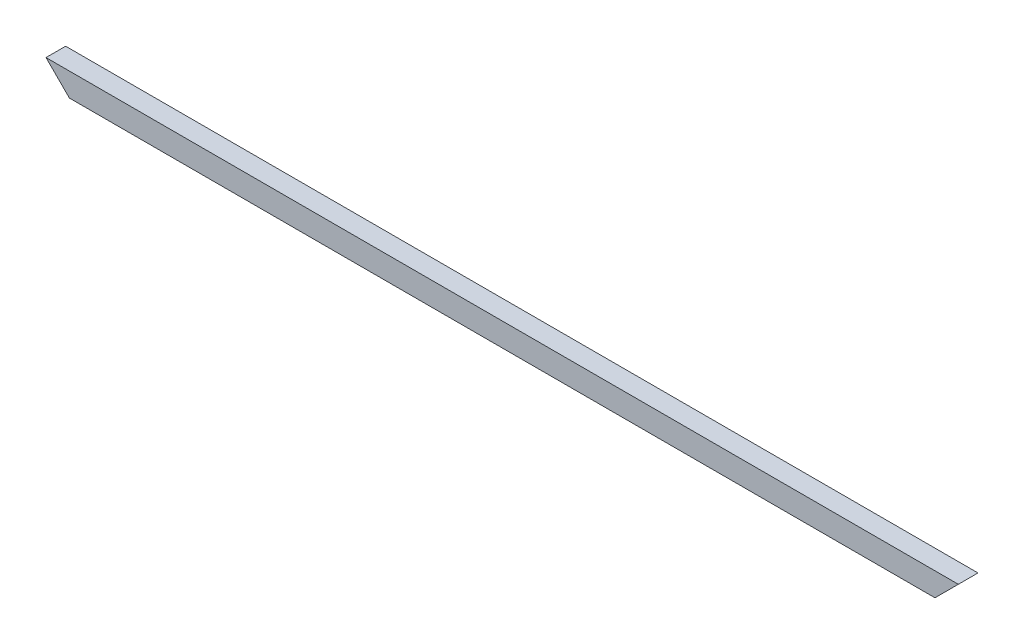
ISO-10303-21;
HEADER;
FILE_DESCRIPTION(('STEP AP214'),'2;1');
FILE_NAME('part.step','',(''),(''),'','','');
FILE_SCHEMA(('AUTOMOTIVE_DESIGN { 1 0 10303 214 1 1 1 1 }'));
ENDSEC;
DATA;
#1=APPLICATION_CONTEXT('core data for automotive mechanical design processes');
#2=APPLICATION_PROTOCOL_DEFINITION('international standard','automotive_design',2000,#1);
#3=PRODUCT_CONTEXT('',#1,'mechanical');
#4=PRODUCT('Part','Part','',(#3));
#5=PRODUCT_RELATED_PRODUCT_CATEGORY('part','',(#4));
#6=PRODUCT_DEFINITION_FORMATION('','',#4);
#7=PRODUCT_DEFINITION_CONTEXT('part definition',#1,'design');
#8=PRODUCT_DEFINITION('design','',#6,#7);
#9=PRODUCT_DEFINITION_SHAPE('','',#8);
#10=(LENGTH_UNIT() NAMED_UNIT(*) SI_UNIT(.MILLI.,.METRE.));
#11=(NAMED_UNIT(*) PLANE_ANGLE_UNIT() SI_UNIT($,.RADIAN.));
#12=(NAMED_UNIT(*) SI_UNIT($,.STERADIAN.) SOLID_ANGLE_UNIT());
#13=UNCERTAINTY_MEASURE_WITH_UNIT(LENGTH_MEASURE(1.E-05),#10,'distance_accuracy_value','');
#14=(GEOMETRIC_REPRESENTATION_CONTEXT(3) GLOBAL_UNCERTAINTY_ASSIGNED_CONTEXT((#13)) GLOBAL_UNIT_ASSIGNED_CONTEXT((#10,
#11,#12)) REPRESENTATION_CONTEXT('',''));
#15=CARTESIAN_POINT('',(0.,0.,0.));
#16=DIRECTION('',(0.,0.,1.));
#17=DIRECTION('',(1.,0.,0.));
#18=AXIS2_PLACEMENT_3D('',#15,#16,#17);
#19=CARTESIAN_POINT('',(371.475,-17.4,6.35));
#20=DIRECTION('',(0.,1.,0.));
#21=DIRECTION('',(0.,0.,1.));
#22=AXIS2_PLACEMENT_3D('',#19,#20,#21);
#23=PLANE('',#22);
#24=DIRECTION('',(-1.,0.,0.));
#25=VECTOR('',#24,1.);
#26=CARTESIAN_POINT('',(371.475,-17.4,8.));
#27=LINE('',#26,#25);
#28=CARTESIAN_POINT('',(352.425,-17.4,8.));
#29=VERTEX_POINT('',#28);
#30=CARTESIAN_POINT('',(-352.425,-17.4,8.));
#31=VERTEX_POINT('',#30);
#32=EDGE_CURVE('E118',#29,#31,#27,.T.);
#33=ORIENTED_EDGE('',*,*,#32,.T.);
#34=DIRECTION('',(0.,0.,-1.));
#35=VECTOR('',#34,1.);
#36=CARTESIAN_POINT('',(-352.425,-17.4,8.));
#37=LINE('',#36,#35);
#38=CARTESIAN_POINT('',(-352.425,-17.4,6.35));
#39=VERTEX_POINT('',#38);
#40=EDGE_CURVE('E100',#31,#39,#37,.T.);
#41=ORIENTED_EDGE('',*,*,#40,.T.);
#42=DIRECTION('',(-1.,0.,0.));
#43=VECTOR('',#42,1.);
#44=CARTESIAN_POINT('',(371.475,-17.4,6.35));
#45=LINE('',#44,#43);
#46=CARTESIAN_POINT('',(352.425,-17.4,6.35));
#47=VERTEX_POINT('',#46);
#48=EDGE_CURVE('E11',#47,#39,#45,.T.);
#49=ORIENTED_EDGE('',*,*,#48,.F.);
#50=DIRECTION('',(0.,0.,-1.));
#51=VECTOR('',#50,1.);
#52=CARTESIAN_POINT('',(352.425,-17.4,8.));
#53=LINE('',#52,#51);
#54=EDGE_CURVE('E123',#29,#47,#53,.T.);
#55=ORIENTED_EDGE('',*,*,#54,.F.);
#56=EDGE_LOOP('',(#33,#41,#49,#55));
#57=FACE_BOUND('',#56,.T.);
#58=ADVANCED_FACE('F41',(#57),#23,.F.);
#59=CARTESIAN_POINT('',(371.475,-17.4,6.35));
#60=DIRECTION('',(0.,0.,1.));
#61=DIRECTION('',(1.,0.,0.));
#62=AXIS2_PLACEMENT_3D('',#59,#60,#61);
#63=PLANE('',#62);
#64=ORIENTED_EDGE('',*,*,#48,.T.);
#65=DIRECTION('',(-0.707106781186539,0.707106781186556,0.));
#66=VECTOR('',#65,1.);
#67=CARTESIAN_POINT('',(9.52499999999157,-379.35,6.35));
#68=LINE('',#67,#66);
#69=CARTESIAN_POINT('',(-369.825,0.,6.35));
#70=VERTEX_POINT('',#69);
#71=EDGE_CURVE('E106',#39,#70,#68,.T.);
#72=ORIENTED_EDGE('',*,*,#71,.T.);
#73=DIRECTION('',(-1.,0.,0.));
#74=VECTOR('',#73,1.);
#75=CARTESIAN_POINT('',(371.475,0.,6.35));
#76=LINE('',#75,#74);
#77=CARTESIAN_POINT('',(369.825,0.,6.35));
#78=VERTEX_POINT('',#77);
#79=EDGE_CURVE('E49',#78,#70,#76,.T.);
#80=ORIENTED_EDGE('',*,*,#79,.F.);
#81=DIRECTION('',(-0.707106781186556,-0.707106781186539,0.));
#82=VECTOR('',#81,1.);
#83=CARTESIAN_POINT('',(361.95,-7.87499999999977,6.35));
#84=LINE('',#83,#82);
#85=EDGE_CURVE('E154',#78,#47,#84,.T.);
#86=ORIENTED_EDGE('',*,*,#85,.T.);
#87=EDGE_LOOP('',(#64,#72,#80,#86));
#88=FACE_BOUND('',#87,.T.);
#89=ADVANCED_FACE('F153',(#88),#63,.F.);
#90=CARTESIAN_POINT('',(371.475,0.,6.35));
#91=DIRECTION('',(0.,1.,0.));
#92=DIRECTION('',(0.,0.,1.));
#93=AXIS2_PLACEMENT_3D('',#90,#91,#92);
#94=PLANE('',#93);
#95=ORIENTED_EDGE('',*,*,#79,.T.);
#96=DIRECTION('',(0.,0.,-1.));
#97=VECTOR('',#96,1.);
#98=CARTESIAN_POINT('',(-369.825,0.,6.35000000000005));
#99=LINE('',#98,#97);
#100=CARTESIAN_POINT('',(-369.825,0.,-6.35));
#101=VERTEX_POINT('',#100);
#102=EDGE_CURVE('E149',#70,#101,#99,.T.);
#103=ORIENTED_EDGE('',*,*,#102,.T.);
#104=DIRECTION('',(-1.,0.,0.));
#105=VECTOR('',#104,1.);
#106=CARTESIAN_POINT('',(371.475,0.,-6.35));
#107=LINE('',#106,#105);
#108=CARTESIAN_POINT('',(369.825,0.,-6.35));
#109=VERTEX_POINT('',#108);
#110=EDGE_CURVE('E140',#109,#101,#107,.T.);
#111=ORIENTED_EDGE('',*,*,#110,.F.);
#112=DIRECTION('',(0.,0.,1.));
#113=VECTOR('',#112,1.);
#114=CARTESIAN_POINT('',(369.825,0.,6.35));
#115=LINE('',#114,#113);
#116=EDGE_CURVE('E150',#109,#78,#115,.T.);
#117=ORIENTED_EDGE('',*,*,#116,.T.);
#118=EDGE_LOOP('',(#95,#103,#111,#117));
#119=FACE_BOUND('',#118,.T.);
#120=ADVANCED_FACE('F147',(#119),#94,.F.);
#121=CARTESIAN_POINT('',(371.475,0.,-6.35));
#122=DIRECTION('',(0.,0.,-1.));
#123=DIRECTION('',(-1.,0.,0.));
#124=AXIS2_PLACEMENT_3D('',#121,#122,#123);
#125=PLANE('',#124);
#126=ORIENTED_EDGE('',*,*,#110,.T.);
#127=DIRECTION('',(0.707106781186539,-0.707106781186556,0.));
#128=VECTOR('',#127,1.);
#129=CARTESIAN_POINT('',(0.824999999991471,-370.65,-6.35));
#130=LINE('',#129,#128);
#131=CARTESIAN_POINT('',(-352.425,-17.4,-6.35));
#132=VERTEX_POINT('',#131);
#133=EDGE_CURVE('E159',#101,#132,#130,.T.);
#134=ORIENTED_EDGE('',*,*,#133,.T.);
#135=DIRECTION('',(-1.,0.,0.));
#136=VECTOR('',#135,1.);
#137=CARTESIAN_POINT('',(371.475,-17.4,-6.35));
#138=LINE('',#137,#136);
#139=CARTESIAN_POINT('',(352.425,-17.4,-6.35));
#140=VERTEX_POINT('',#139);
#141=EDGE_CURVE('E137',#140,#132,#138,.T.);
#142=ORIENTED_EDGE('',*,*,#141,.F.);
#143=DIRECTION('',(0.707106781186556,0.707106781186539,0.));
#144=VECTOR('',#143,1.);
#145=CARTESIAN_POINT('',(370.65,0.825000000000022,-6.35));
#146=LINE('',#145,#144);
#147=EDGE_CURVE('E165',#140,#109,#146,.T.);
#148=ORIENTED_EDGE('',*,*,#147,.T.);
#149=EDGE_LOOP('',(#126,#134,#142,#148));
#150=FACE_BOUND('',#149,.T.);
#151=ADVANCED_FACE('F181',(#150),#125,.F.);
#152=CARTESIAN_POINT('',(371.475,-17.4,-6.35));
#153=DIRECTION('',(0.,1.,0.));
#154=DIRECTION('',(0.,0.,1.));
#155=AXIS2_PLACEMENT_3D('',#152,#153,#154);
#156=PLANE('',#155);
#157=ORIENTED_EDGE('',*,*,#141,.T.);
#158=CARTESIAN_POINT('',(-352.425,-17.4,-8.));
#159=VERTEX_POINT('',#158);
#160=EDGE_CURVE('E111',#132,#159,#37,.T.);
#161=ORIENTED_EDGE('',*,*,#160,.T.);
#162=DIRECTION('',(-1.,0.,0.));
#163=VECTOR('',#162,1.);
#164=CARTESIAN_POINT('',(371.475,-17.4,-8.));
#165=LINE('',#164,#163);
#166=CARTESIAN_POINT('',(352.425,-17.4,-8.));
#167=VERTEX_POINT('',#166);
#168=EDGE_CURVE('E134',#167,#159,#165,.T.);
#169=ORIENTED_EDGE('',*,*,#168,.F.);
#170=EDGE_CURVE('E157',#140,#167,#53,.T.);
#171=ORIENTED_EDGE('',*,*,#170,.F.);
#172=EDGE_LOOP('',(#157,#161,#169,#171));
#173=FACE_BOUND('',#172,.T.);
#174=ADVANCED_FACE('F184',(#173),#156,.F.);
#175=CARTESIAN_POINT('',(371.475,1.65,-8.));
#176=DIRECTION('',(0.,0.,1.));
#177=DIRECTION('',(0.,-1.,0.));
#178=AXIS2_PLACEMENT_3D('',#175,#176,#177);
#179=PLANE('',#178);
#180=ORIENTED_EDGE('',*,*,#168,.T.);
#181=DIRECTION('',(-0.707106781186539,0.707106781186556,0.));
#182=VECTOR('',#181,1.);
#183=CARTESIAN_POINT('',(-8.43769498715119E-12,-369.825,-8.00000000000003));
#184=LINE('',#183,#182);
#185=CARTESIAN_POINT('',(-371.475,1.65,-8.));
#186=VERTEX_POINT('',#185);
#187=EDGE_CURVE('E110',#159,#186,#184,.T.);
#188=ORIENTED_EDGE('',*,*,#187,.T.);
#189=DIRECTION('',(-1.,0.,0.));
#190=VECTOR('',#189,1.);
#191=CARTESIAN_POINT('',(371.475,1.65,-8.));
#192=LINE('',#191,#190);
#193=CARTESIAN_POINT('',(371.475,1.65,-8.));
#194=VERTEX_POINT('',#193);
#195=EDGE_CURVE('E126',#194,#186,#192,.T.);
#196=ORIENTED_EDGE('',*,*,#195,.F.);
#197=DIRECTION('',(-0.707106781186556,-0.707106781186539,0.));
#198=VECTOR('',#197,1.);
#199=CARTESIAN_POINT('',(371.475,1.65,-8.));
#200=LINE('',#199,#198);
#201=EDGE_CURVE('E55',#194,#167,#200,.T.);
#202=ORIENTED_EDGE('',*,*,#201,.T.);
#203=EDGE_LOOP('',(#180,#188,#196,#202));
#204=FACE_BOUND('',#203,.T.);
#205=ADVANCED_FACE('F175',(#204),#179,.F.);
#206=CARTESIAN_POINT('',(371.475,1.65,8.));
#207=DIRECTION('',(0.,-1.,0.));
#208=DIRECTION('',(0.,0.,-1.));
#209=AXIS2_PLACEMENT_3D('',#206,#207,#208);
#210=PLANE('',#209);
#211=DIRECTION('',(0.,0.,1.));
#212=VECTOR('',#211,1.);
#213=CARTESIAN_POINT('',(-371.475,1.65,8.));
#214=LINE('',#213,#212);
#215=CARTESIAN_POINT('',(-371.475,1.65,8.));
#216=VERTEX_POINT('',#215);
#217=EDGE_CURVE('E128',#186,#216,#214,.T.);
#218=ORIENTED_EDGE('',*,*,#217,.T.);
#219=DIRECTION('',(-1.,0.,0.));
#220=VECTOR('',#219,1.);
#221=CARTESIAN_POINT('',(371.475,1.65,8.));
#222=LINE('',#221,#220);
#223=CARTESIAN_POINT('',(371.475,1.65,8.));
#224=VERTEX_POINT('',#223);
#225=EDGE_CURVE('E120',#224,#216,#222,.T.);
#226=ORIENTED_EDGE('',*,*,#225,.F.);
#227=DIRECTION('',(0.,0.,1.));
#228=VECTOR('',#227,1.);
#229=CARTESIAN_POINT('',(371.475,1.65,8.));
#230=LINE('',#229,#228);
#231=EDGE_CURVE('E124',#194,#224,#230,.T.);
#232=ORIENTED_EDGE('',*,*,#231,.F.);
#233=ORIENTED_EDGE('',*,*,#195,.T.);
#234=EDGE_LOOP('',(#218,#226,#232,#233));
#235=FACE_BOUND('',#234,.T.);
#236=ADVANCED_FACE('F170',(#235),#210,.F.);
#237=CARTESIAN_POINT('',(371.475,-17.4,8.));
#238=DIRECTION('',(0.,0.,-1.));
#239=DIRECTION('',(-1.,0.,0.));
#240=AXIS2_PLACEMENT_3D('',#237,#238,#239);
#241=PLANE('',#240);
#242=ORIENTED_EDGE('',*,*,#225,.T.);
#243=DIRECTION('',(0.70710678118654,-0.707106781186556,0.));
#244=VECTOR('',#243,1.);
#245=CARTESIAN_POINT('',(-371.475,1.65,8.));
#246=LINE('',#245,#244);
#247=EDGE_CURVE('E103',#216,#31,#246,.T.);
#248=ORIENTED_EDGE('',*,*,#247,.T.);
#249=ORIENTED_EDGE('',*,*,#32,.F.);
#250=DIRECTION('',(0.707106781186556,0.707106781186539,0.));
#251=VECTOR('',#250,1.);
#252=CARTESIAN_POINT('',(371.475,1.65,8.));
#253=LINE('',#252,#251);
#254=EDGE_CURVE('E155',#29,#224,#253,.T.);
#255=ORIENTED_EDGE('',*,*,#254,.T.);
#256=EDGE_LOOP('',(#242,#248,#249,#255));
#257=FACE_BOUND('',#256,.T.);
#258=ADVANCED_FACE('F116',(#257),#241,.F.);
#259=CARTESIAN_POINT('',(371.475,1.65,8.));
#260=DIRECTION('',(-0.707106781186539,0.707106781186556,0.));
#261=DIRECTION('',(-0.707106781186556,-0.707106781186539,0.));
#262=AXIS2_PLACEMENT_3D('',#259,#260,#261);
#263=PLANE('',#262);
#264=ORIENTED_EDGE('',*,*,#116,.F.);
#265=ORIENTED_EDGE('',*,*,#147,.F.);
#266=ORIENTED_EDGE('',*,*,#170,.T.);
#267=ORIENTED_EDGE('',*,*,#201,.F.);
#268=ORIENTED_EDGE('',*,*,#231,.T.);
#269=ORIENTED_EDGE('',*,*,#254,.F.);
#270=ORIENTED_EDGE('',*,*,#54,.T.);
#271=ORIENTED_EDGE('',*,*,#85,.F.);
#272=EDGE_LOOP('',(#264,#265,#266,#267,#268,#269,#270,#271));
#273=FACE_BOUND('',#272,.T.);
#274=ADVANCED_FACE('F185',(#273),#263,.F.);
#275=CARTESIAN_POINT('',(-371.475,1.65,8.));
#276=DIRECTION('',(0.707106781186556,0.70710678118654,0.));
#277=DIRECTION('',(-0.707106781186539,0.707106781186556,0.));
#278=AXIS2_PLACEMENT_3D('',#275,#276,#277);
#279=PLANE('',#278);
#280=ORIENTED_EDGE('',*,*,#40,.F.);
#281=ORIENTED_EDGE('',*,*,#247,.F.);
#282=ORIENTED_EDGE('',*,*,#217,.F.);
#283=ORIENTED_EDGE('',*,*,#187,.F.);
#284=ORIENTED_EDGE('',*,*,#160,.F.);
#285=ORIENTED_EDGE('',*,*,#133,.F.);
#286=ORIENTED_EDGE('',*,*,#102,.F.);
#287=ORIENTED_EDGE('',*,*,#71,.F.);
#288=EDGE_LOOP('',(#280,#281,#282,#283,#284,#285,#286,#287));
#289=FACE_BOUND('',#288,.T.);
#290=ADVANCED_FACE('F102',(#289),#279,.F.);
#291=CLOSED_SHELL('',(#58,#89,#120,#151,#174,#205,#236,#258,#274,#290));
#292=MANIFOLD_SOLID_BREP('B2',#291);
#293=ADVANCED_BREP_SHAPE_REPRESENTATION('',(#18,#292),#14);
#294=SHAPE_DEFINITION_REPRESENTATION(#9,#293);
ENDSEC;
END-ISO-10303-21;
